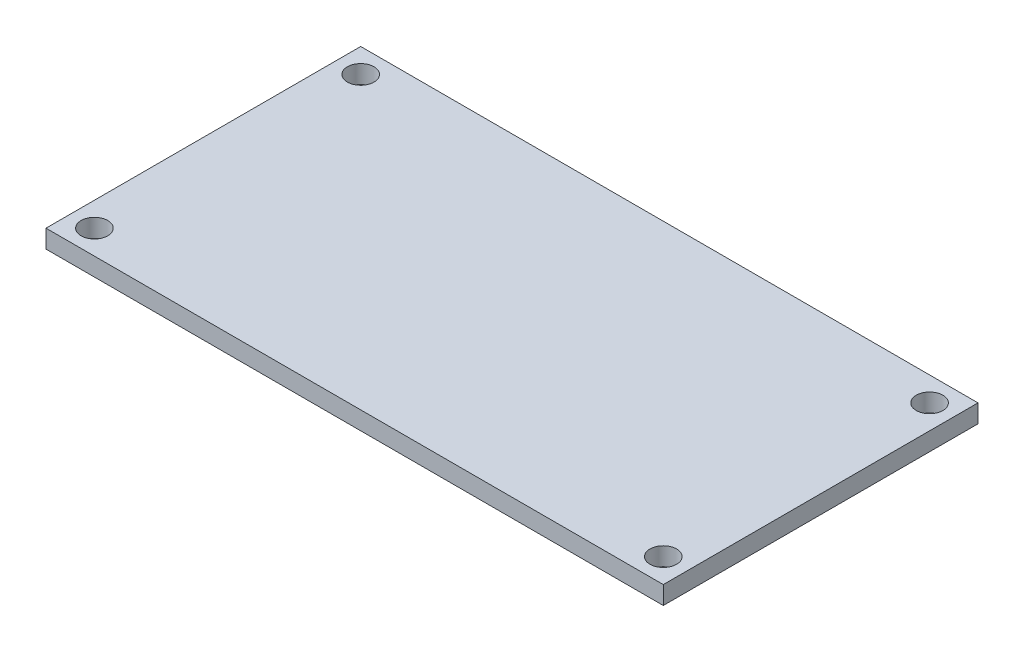
ISO-10303-21;
HEADER;
FILE_DESCRIPTION(('STEP AP214'),'2;1');
FILE_NAME('part.step','',(''),(''),'','','');
FILE_SCHEMA(('AUTOMOTIVE_DESIGN { 1 0 10303 214 1 1 1 1 }'));
ENDSEC;
DATA;
#1=APPLICATION_CONTEXT('core data for automotive mechanical design processes');
#2=APPLICATION_PROTOCOL_DEFINITION('international standard','automotive_design',2000,#1);
#3=PRODUCT_CONTEXT('',#1,'mechanical');
#4=PRODUCT('Part','Part','',(#3));
#5=PRODUCT_RELATED_PRODUCT_CATEGORY('part','',(#4));
#6=PRODUCT_DEFINITION_FORMATION('','',#4);
#7=PRODUCT_DEFINITION_CONTEXT('part definition',#1,'design');
#8=PRODUCT_DEFINITION('design','',#6,#7);
#9=PRODUCT_DEFINITION_SHAPE('','',#8);
#10=(LENGTH_UNIT() NAMED_UNIT(*) SI_UNIT(.MILLI.,.METRE.));
#11=(NAMED_UNIT(*) PLANE_ANGLE_UNIT() SI_UNIT($,.RADIAN.));
#12=(NAMED_UNIT(*) SI_UNIT($,.STERADIAN.) SOLID_ANGLE_UNIT());
#13=UNCERTAINTY_MEASURE_WITH_UNIT(LENGTH_MEASURE(1.E-05),#10,'distance_accuracy_value','');
#14=(GEOMETRIC_REPRESENTATION_CONTEXT(3) GLOBAL_UNCERTAINTY_ASSIGNED_CONTEXT((#13)) GLOBAL_UNIT_ASSIGNED_CONTEXT((#10,
#11,#12)) REPRESENTATION_CONTEXT('',''));
#15=CARTESIAN_POINT('',(0.,0.,0.));
#16=DIRECTION('',(0.,0.,1.));
#17=DIRECTION('',(1.,0.,0.));
#18=AXIS2_PLACEMENT_3D('',#15,#16,#17);
#19=CARTESIAN_POINT('',(0.,1.5,0.));
#20=DIRECTION('',(0.,-1.,0.));
#21=DIRECTION('',(0.,0.,-1.));
#22=AXIS2_PLACEMENT_3D('',#19,#20,#21);
#23=PLANE('',#22);
#24=DIRECTION('',(0.,0.,1.));
#25=VECTOR('',#24,1.);
#26=CARTESIAN_POINT('',(0.,1.5,0.));
#27=LINE('',#26,#25);
#28=CARTESIAN_POINT('',(0.,1.5,-26.));
#29=VERTEX_POINT('',#28);
#30=CARTESIAN_POINT('',(0.,1.5,0.));
#31=VERTEX_POINT('',#30);
#32=EDGE_CURVE('E85',#29,#31,#27,.T.);
#33=ORIENTED_EDGE('',*,*,#32,.T.);
#34=DIRECTION('',(1.,0.,0.));
#35=VECTOR('',#34,1.);
#36=CARTESIAN_POINT('',(0.,1.5,0.));
#37=LINE('',#36,#35);
#38=CARTESIAN_POINT('',(51.,1.5,0.));
#39=VERTEX_POINT('',#38);
#40=EDGE_CURVE('E80',#31,#39,#37,.T.);
#41=ORIENTED_EDGE('',*,*,#40,.T.);
#42=DIRECTION('',(0.,0.,-1.));
#43=VECTOR('',#42,1.);
#44=CARTESIAN_POINT('',(51.,1.5,0.));
#45=LINE('',#44,#43);
#46=CARTESIAN_POINT('',(51.,1.5,-26.));
#47=VERTEX_POINT('',#46);
#48=EDGE_CURVE('E83',#39,#47,#45,.T.);
#49=ORIENTED_EDGE('',*,*,#48,.T.);
#50=DIRECTION('',(-1.,0.,0.));
#51=VECTOR('',#50,1.);
#52=CARTESIAN_POINT('',(0.,1.5,-26.));
#53=LINE('',#52,#51);
#54=EDGE_CURVE('E50',#47,#29,#53,.T.);
#55=ORIENTED_EDGE('',*,*,#54,.T.);
#56=EDGE_LOOP('',(#33,#41,#49,#55));
#57=FACE_BOUND('',#56,.T.);
#58=CARTESIAN_POINT('',(2.,1.5,-2.));
#59=DIRECTION('',(0.,1.,0.));
#60=DIRECTION('',(0.,0.,1.));
#61=AXIS2_PLACEMENT_3D('',#58,#59,#60);
#62=CIRCLE('',#61,1.1);
#63=CARTESIAN_POINT('',(2.,1.5,-0.9));
#64=VERTEX_POINT('',#63);
#65=EDGE_CURVE('E100',#64,#64,#62,.T.);
#66=ORIENTED_EDGE('',*,*,#65,.F.);
#67=EDGE_LOOP('',(#66));
#68=FACE_BOUND('',#67,.T.);
#69=CARTESIAN_POINT('',(49.,1.5,-2.));
#70=DIRECTION('',(0.,1.,0.));
#71=DIRECTION('',(0.,0.,1.));
#72=AXIS2_PLACEMENT_3D('',#69,#70,#71);
#73=CIRCLE('',#72,1.1);
#74=CARTESIAN_POINT('',(49.,1.5,-0.900000000000001));
#75=VERTEX_POINT('',#74);
#76=EDGE_CURVE('E115',#75,#75,#73,.T.);
#77=ORIENTED_EDGE('',*,*,#76,.F.);
#78=EDGE_LOOP('',(#77));
#79=FACE_BOUND('',#78,.T.);
#80=CARTESIAN_POINT('',(48.9999999999999,1.5,-24.));
#81=DIRECTION('',(0.,1.,0.));
#82=DIRECTION('',(0.,0.,1.));
#83=AXIS2_PLACEMENT_3D('',#80,#81,#82);
#84=CIRCLE('',#83,1.1);
#85=CARTESIAN_POINT('',(48.9999999999999,1.5,-22.9));
#86=VERTEX_POINT('',#85);
#87=EDGE_CURVE('E121',#86,#86,#84,.T.);
#88=ORIENTED_EDGE('',*,*,#87,.F.);
#89=EDGE_LOOP('',(#88));
#90=FACE_BOUND('',#89,.T.);
#91=CARTESIAN_POINT('',(1.99999999999992,1.5,-24.));
#92=DIRECTION('',(0.,1.,0.));
#93=DIRECTION('',(0.,0.,1.));
#94=AXIS2_PLACEMENT_3D('',#91,#92,#93);
#95=CIRCLE('',#94,1.1);
#96=CARTESIAN_POINT('',(1.99999999999992,1.5,-22.9));
#97=VERTEX_POINT('',#96);
#98=EDGE_CURVE('E127',#97,#97,#95,.T.);
#99=ORIENTED_EDGE('',*,*,#98,.F.);
#100=EDGE_LOOP('',(#99));
#101=FACE_BOUND('',#100,.T.);
#102=ADVANCED_FACE('F33',(#57,#68,#79,#90,#101),#23,.F.);
#103=CARTESIAN_POINT('',(0.,0.,0.));
#104=DIRECTION('',(0.,-1.,0.));
#105=DIRECTION('',(0.,0.,-1.));
#106=AXIS2_PLACEMENT_3D('',#103,#104,#105);
#107=PLANE('',#106);
#108=CARTESIAN_POINT('',(48.9999999999999,0.,-24.));
#109=DIRECTION('',(0.,1.,0.));
#110=DIRECTION('',(0.,0.,1.));
#111=AXIS2_PLACEMENT_3D('',#108,#109,#110);
#112=CIRCLE('',#111,1.1);
#113=CARTESIAN_POINT('',(48.9999999999999,0.,-22.9));
#114=VERTEX_POINT('',#113);
#115=EDGE_CURVE('E124',#114,#114,#112,.T.);
#116=ORIENTED_EDGE('',*,*,#115,.T.);
#117=EDGE_LOOP('',(#116));
#118=FACE_BOUND('',#117,.T.);
#119=CARTESIAN_POINT('',(2.,0.,-2.));
#120=DIRECTION('',(0.,1.,0.));
#121=DIRECTION('',(0.,0.,1.));
#122=AXIS2_PLACEMENT_3D('',#119,#120,#121);
#123=CIRCLE('',#122,1.1);
#124=CARTESIAN_POINT('',(2.,0.,-0.9));
#125=VERTEX_POINT('',#124);
#126=EDGE_CURVE('E112',#125,#125,#123,.T.);
#127=ORIENTED_EDGE('',*,*,#126,.T.);
#128=EDGE_LOOP('',(#127));
#129=FACE_BOUND('',#128,.T.);
#130=DIRECTION('',(0.,0.,1.));
#131=VECTOR('',#130,1.);
#132=CARTESIAN_POINT('',(0.,0.,0.));
#133=LINE('',#132,#131);
#134=CARTESIAN_POINT('',(0.,0.,-26.));
#135=VERTEX_POINT('',#134);
#136=CARTESIAN_POINT('',(0.,0.,0.));
#137=VERTEX_POINT('',#136);
#138=EDGE_CURVE('E97',#135,#137,#133,.T.);
#139=ORIENTED_EDGE('',*,*,#138,.F.);
#140=DIRECTION('',(-1.,0.,0.));
#141=VECTOR('',#140,1.);
#142=CARTESIAN_POINT('',(0.,0.,-26.));
#143=LINE('',#142,#141);
#144=CARTESIAN_POINT('',(51.,0.,-26.));
#145=VERTEX_POINT('',#144);
#146=EDGE_CURVE('E73',#145,#135,#143,.T.);
#147=ORIENTED_EDGE('',*,*,#146,.F.);
#148=DIRECTION('',(0.,0.,-1.));
#149=VECTOR('',#148,1.);
#150=CARTESIAN_POINT('',(51.,0.,0.));
#151=LINE('',#150,#149);
#152=CARTESIAN_POINT('',(51.,0.,0.));
#153=VERTEX_POINT('',#152);
#154=EDGE_CURVE('E67',#153,#145,#151,.T.);
#155=ORIENTED_EDGE('',*,*,#154,.F.);
#156=DIRECTION('',(1.,0.,0.));
#157=VECTOR('',#156,1.);
#158=CARTESIAN_POINT('',(0.,0.,0.));
#159=LINE('',#158,#157);
#160=EDGE_CURVE('E89',#137,#153,#159,.T.);
#161=ORIENTED_EDGE('',*,*,#160,.F.);
#162=EDGE_LOOP('',(#139,#147,#155,#161));
#163=FACE_BOUND('',#162,.T.);
#164=CARTESIAN_POINT('',(49.,0.,-2.));
#165=DIRECTION('',(0.,1.,0.));
#166=DIRECTION('',(0.,0.,1.));
#167=AXIS2_PLACEMENT_3D('',#164,#165,#166);
#168=CIRCLE('',#167,1.1);
#169=CARTESIAN_POINT('',(49.,0.,-0.900000000000001));
#170=VERTEX_POINT('',#169);
#171=EDGE_CURVE('E118',#170,#170,#168,.T.);
#172=ORIENTED_EDGE('',*,*,#171,.T.);
#173=EDGE_LOOP('',(#172));
#174=FACE_BOUND('',#173,.T.);
#175=CARTESIAN_POINT('',(1.99999999999992,0.,-24.));
#176=DIRECTION('',(0.,1.,0.));
#177=DIRECTION('',(0.,0.,1.));
#178=AXIS2_PLACEMENT_3D('',#175,#176,#177);
#179=CIRCLE('',#178,1.1);
#180=CARTESIAN_POINT('',(1.99999999999992,0.,-22.9));
#181=VERTEX_POINT('',#180);
#182=EDGE_CURVE('E130',#181,#181,#179,.T.);
#183=ORIENTED_EDGE('',*,*,#182,.T.);
#184=EDGE_LOOP('',(#183));
#185=FACE_BOUND('',#184,.T.);
#186=ADVANCED_FACE('F108',(#118,#129,#163,#174,#185),#107,.T.);
#187=CARTESIAN_POINT('',(0.,1.5,0.));
#188=DIRECTION('',(1.,0.,0.));
#189=DIRECTION('',(0.,0.,-1.));
#190=AXIS2_PLACEMENT_3D('',#187,#188,#189);
#191=PLANE('',#190);
#192=ORIENTED_EDGE('',*,*,#138,.T.);
#193=DIRECTION('',(0.,-1.,0.));
#194=VECTOR('',#193,1.);
#195=CARTESIAN_POINT('',(0.,1.5,0.));
#196=LINE('',#195,#194);
#197=EDGE_CURVE('E11',#31,#137,#196,.T.);
#198=ORIENTED_EDGE('',*,*,#197,.F.);
#199=ORIENTED_EDGE('',*,*,#32,.F.);
#200=DIRECTION('',(0.,-1.,0.));
#201=VECTOR('',#200,1.);
#202=CARTESIAN_POINT('',(0.,1.5,-26.));
#203=LINE('',#202,#201);
#204=EDGE_CURVE('E93',#29,#135,#203,.T.);
#205=ORIENTED_EDGE('',*,*,#204,.T.);
#206=EDGE_LOOP('',(#192,#198,#199,#205));
#207=FACE_BOUND('',#206,.T.);
#208=ADVANCED_FACE('F35',(#207),#191,.F.);
#209=CARTESIAN_POINT('',(0.,1.5,0.));
#210=DIRECTION('',(0.,0.,-1.));
#211=DIRECTION('',(-1.,0.,0.));
#212=AXIS2_PLACEMENT_3D('',#209,#210,#211);
#213=PLANE('',#212);
#214=ORIENTED_EDGE('',*,*,#160,.T.);
#215=DIRECTION('',(0.,-1.,0.));
#216=VECTOR('',#215,1.);
#217=CARTESIAN_POINT('',(51.,1.5,0.));
#218=LINE('',#217,#216);
#219=EDGE_CURVE('E42',#39,#153,#218,.T.);
#220=ORIENTED_EDGE('',*,*,#219,.F.);
#221=ORIENTED_EDGE('',*,*,#40,.F.);
#222=ORIENTED_EDGE('',*,*,#197,.T.);
#223=EDGE_LOOP('',(#214,#220,#221,#222));
#224=FACE_BOUND('',#223,.T.);
#225=ADVANCED_FACE('F88',(#224),#213,.F.);
#226=CARTESIAN_POINT('',(51.,1.5,0.));
#227=DIRECTION('',(-1.,0.,0.));
#228=DIRECTION('',(0.,0.,1.));
#229=AXIS2_PLACEMENT_3D('',#226,#227,#228);
#230=PLANE('',#229);
#231=ORIENTED_EDGE('',*,*,#154,.T.);
#232=DIRECTION('',(0.,-1.,0.));
#233=VECTOR('',#232,1.);
#234=CARTESIAN_POINT('',(51.,1.5,-26.));
#235=LINE('',#234,#233);
#236=EDGE_CURVE('E90',#47,#145,#235,.T.);
#237=ORIENTED_EDGE('',*,*,#236,.F.);
#238=ORIENTED_EDGE('',*,*,#48,.F.);
#239=ORIENTED_EDGE('',*,*,#219,.T.);
#240=EDGE_LOOP('',(#231,#237,#238,#239));
#241=FACE_BOUND('',#240,.T.);
#242=ADVANCED_FACE('F91',(#241),#230,.F.);
#243=CARTESIAN_POINT('',(0.,1.5,-26.));
#244=DIRECTION('',(0.,0.,1.));
#245=DIRECTION('',(1.,0.,0.));
#246=AXIS2_PLACEMENT_3D('',#243,#244,#245);
#247=PLANE('',#246);
#248=ORIENTED_EDGE('',*,*,#146,.T.);
#249=ORIENTED_EDGE('',*,*,#204,.F.);
#250=ORIENTED_EDGE('',*,*,#54,.F.);
#251=ORIENTED_EDGE('',*,*,#236,.T.);
#252=EDGE_LOOP('',(#248,#249,#250,#251));
#253=FACE_BOUND('',#252,.T.);
#254=ADVANCED_FACE('F105',(#253),#247,.F.);
#255=CARTESIAN_POINT('',(2.,1.5,-2.));
#256=DIRECTION('',(0.,-1.,0.));
#257=DIRECTION('',(0.,0.,-1.));
#258=AXIS2_PLACEMENT_3D('',#255,#256,#257);
#259=CYLINDRICAL_SURFACE('',#258,1.1);
#260=ORIENTED_EDGE('',*,*,#65,.T.);
#261=EDGE_LOOP('',(#260));
#262=FACE_BOUND('',#261,.T.);
#263=ORIENTED_EDGE('',*,*,#126,.F.);
#264=EDGE_LOOP('',(#263));
#265=FACE_BOUND('',#264,.T.);
#266=ADVANCED_FACE('F147',(#262,#265),#259,.F.);
#267=CARTESIAN_POINT('',(49.,1.5,-2.));
#268=DIRECTION('',(0.,-1.,0.));
#269=DIRECTION('',(0.,0.,-1.));
#270=AXIS2_PLACEMENT_3D('',#267,#268,#269);
#271=CYLINDRICAL_SURFACE('',#270,1.1);
#272=ORIENTED_EDGE('',*,*,#76,.T.);
#273=EDGE_LOOP('',(#272));
#274=FACE_BOUND('',#273,.T.);
#275=ORIENTED_EDGE('',*,*,#171,.F.);
#276=EDGE_LOOP('',(#275));
#277=FACE_BOUND('',#276,.T.);
#278=ADVANCED_FACE('F193',(#274,#277),#271,.F.);
#279=CARTESIAN_POINT('',(48.9999999999999,1.5,-24.));
#280=DIRECTION('',(0.,-1.,0.));
#281=DIRECTION('',(0.,0.,-1.));
#282=AXIS2_PLACEMENT_3D('',#279,#280,#281);
#283=CYLINDRICAL_SURFACE('',#282,1.1);
#284=ORIENTED_EDGE('',*,*,#87,.T.);
#285=EDGE_LOOP('',(#284));
#286=FACE_BOUND('',#285,.T.);
#287=ORIENTED_EDGE('',*,*,#115,.F.);
#288=EDGE_LOOP('',(#287));
#289=FACE_BOUND('',#288,.T.);
#290=ADVANCED_FACE('F201',(#286,#289),#283,.F.);
#291=CARTESIAN_POINT('',(1.99999999999992,1.5,-24.));
#292=DIRECTION('',(0.,-1.,0.));
#293=DIRECTION('',(0.,0.,-1.));
#294=AXIS2_PLACEMENT_3D('',#291,#292,#293);
#295=CYLINDRICAL_SURFACE('',#294,1.1);
#296=ORIENTED_EDGE('',*,*,#98,.T.);
#297=EDGE_LOOP('',(#296));
#298=FACE_BOUND('',#297,.T.);
#299=ORIENTED_EDGE('',*,*,#182,.F.);
#300=EDGE_LOOP('',(#299));
#301=FACE_BOUND('',#300,.T.);
#302=ADVANCED_FACE('F136',(#298,#301),#295,.F.);
#303=CLOSED_SHELL('',(#102,#186,#208,#225,#242,#254,#266,#278,#290,#302));
#304=MANIFOLD_SOLID_BREP('B2',#303);
#305=ADVANCED_BREP_SHAPE_REPRESENTATION('',(#18,#304),#14);
#306=SHAPE_DEFINITION_REPRESENTATION(#9,#305);
ENDSEC;
END-ISO-10303-21;
